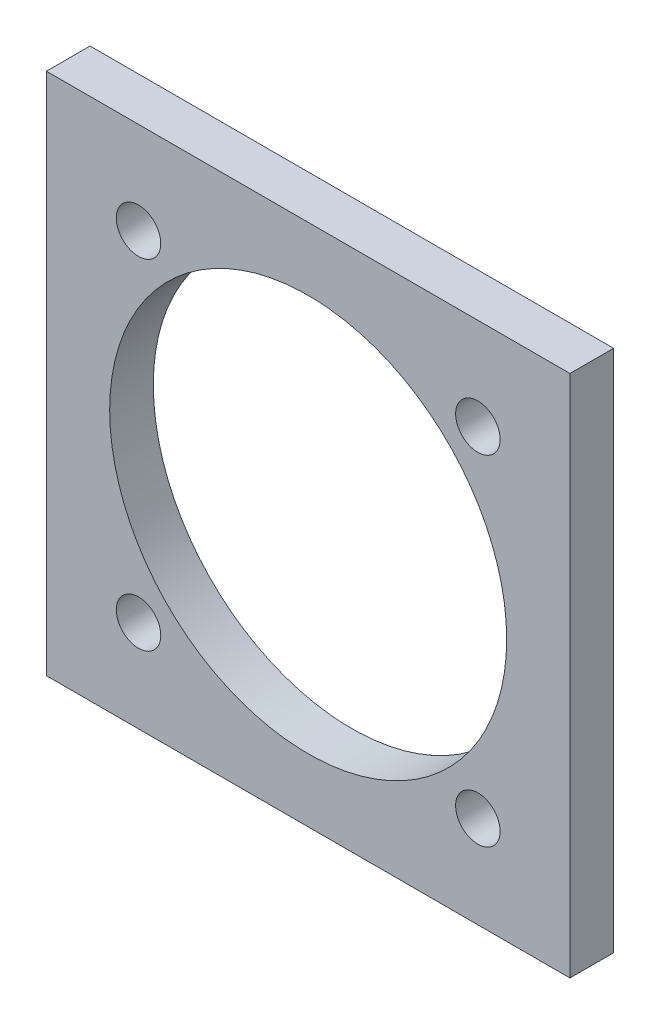
ISO-10303-21;
HEADER;
FILE_DESCRIPTION(('STEP AP214'),'2;1');
FILE_NAME('part.step','',(''),(''),'','','');
FILE_SCHEMA(('AUTOMOTIVE_DESIGN { 1 0 10303 214 1 1 1 1 }'));
ENDSEC;
DATA;
#1=APPLICATION_CONTEXT('core data for automotive mechanical design processes');
#2=APPLICATION_PROTOCOL_DEFINITION('international standard','automotive_design',2000,#1);
#3=PRODUCT_CONTEXT('',#1,'mechanical');
#4=PRODUCT('Part','Part','',(#3));
#5=PRODUCT_RELATED_PRODUCT_CATEGORY('part','',(#4));
#6=PRODUCT_DEFINITION_FORMATION('','',#4);
#7=PRODUCT_DEFINITION_CONTEXT('part definition',#1,'design');
#8=PRODUCT_DEFINITION('design','',#6,#7);
#9=PRODUCT_DEFINITION_SHAPE('','',#8);
#10=(LENGTH_UNIT() NAMED_UNIT(*) SI_UNIT(.MILLI.,.METRE.));
#11=(NAMED_UNIT(*) PLANE_ANGLE_UNIT() SI_UNIT($,.RADIAN.));
#12=(NAMED_UNIT(*) SI_UNIT($,.STERADIAN.) SOLID_ANGLE_UNIT());
#13=UNCERTAINTY_MEASURE_WITH_UNIT(LENGTH_MEASURE(1.E-05),#10,'distance_accuracy_value','');
#14=(GEOMETRIC_REPRESENTATION_CONTEXT(3) GLOBAL_UNCERTAINTY_ASSIGNED_CONTEXT((#13)) GLOBAL_UNIT_ASSIGNED_CONTEXT((#10,
#11,#12)) REPRESENTATION_CONTEXT('',''));
#15=CARTESIAN_POINT('',(0.,0.,0.));
#16=DIRECTION('',(0.,0.,1.));
#17=DIRECTION('',(1.,0.,0.));
#18=AXIS2_PLACEMENT_3D('',#15,#16,#17);
#19=CARTESIAN_POINT('',(0.,0.,10.));
#20=DIRECTION('',(0.,0.,-1.));
#21=DIRECTION('',(-1.,0.,0.));
#22=AXIS2_PLACEMENT_3D('',#19,#20,#21);
#23=PLANE('',#22);
#24=DIRECTION('',(0.,1.,0.));
#25=VECTOR('',#24,1.);
#26=CARTESIAN_POINT('',(60.,-60.,10.));
#27=LINE('',#26,#25);
#28=CARTESIAN_POINT('',(60.,-60.,10.));
#29=VERTEX_POINT('',#28);
#30=CARTESIAN_POINT('',(60.,60.,10.));
#31=VERTEX_POINT('',#30);
#32=EDGE_CURVE('E86',#29,#31,#27,.T.);
#33=ORIENTED_EDGE('',*,*,#32,.T.);
#34=DIRECTION('',(-1.,0.,0.));
#35=VECTOR('',#34,1.);
#36=CARTESIAN_POINT('',(-60.,60.,10.));
#37=LINE('',#36,#35);
#38=CARTESIAN_POINT('',(-60.,60.,10.));
#39=VERTEX_POINT('',#38);
#40=EDGE_CURVE('E81',#31,#39,#37,.T.);
#41=ORIENTED_EDGE('',*,*,#40,.T.);
#42=DIRECTION('',(0.,-1.,0.));
#43=VECTOR('',#42,1.);
#44=CARTESIAN_POINT('',(-60.,-60.,10.));
#45=LINE('',#44,#43);
#46=CARTESIAN_POINT('',(-60.,-60.,10.));
#47=VERTEX_POINT('',#46);
#48=EDGE_CURVE('E84',#39,#47,#45,.T.);
#49=ORIENTED_EDGE('',*,*,#48,.T.);
#50=DIRECTION('',(1.,0.,0.));
#51=VECTOR('',#50,1.);
#52=CARTESIAN_POINT('',(-60.,-60.,10.));
#53=LINE('',#52,#51);
#54=EDGE_CURVE('E51',#47,#29,#53,.T.);
#55=ORIENTED_EDGE('',*,*,#54,.T.);
#56=EDGE_LOOP('',(#33,#41,#49,#55));
#57=FACE_BOUND('',#56,.T.);
#58=CARTESIAN_POINT('',(0.,0.,10.));
#59=DIRECTION('',(0.,0.,1.));
#60=DIRECTION('',(1.,0.,0.));
#61=AXIS2_PLACEMENT_3D('',#58,#59,#60);
#62=CIRCLE('',#61,45.5);
#63=CARTESIAN_POINT('',(45.5,0.,10.));
#64=VERTEX_POINT('',#63);
#65=EDGE_CURVE('E101',#64,#64,#62,.T.);
#66=ORIENTED_EDGE('',*,*,#65,.F.);
#67=EDGE_LOOP('',(#66));
#68=FACE_BOUND('',#67,.T.);
#69=CARTESIAN_POINT('',(38.8908729652601,38.8908729652601,10.));
#70=DIRECTION('',(0.,0.,1.));
#71=DIRECTION('',(1.,0.,0.));
#72=AXIS2_PLACEMENT_3D('',#69,#70,#71);
#73=CIRCLE('',#72,5.1);
#74=CARTESIAN_POINT('',(43.9908729652601,38.8908729652601,10.));
#75=VERTEX_POINT('',#74);
#76=EDGE_CURVE('E116',#75,#75,#73,.T.);
#77=ORIENTED_EDGE('',*,*,#76,.F.);
#78=EDGE_LOOP('',(#77));
#79=FACE_BOUND('',#78,.T.);
#80=CARTESIAN_POINT('',(-38.8908729652601,38.8908729652601,10.));
#81=DIRECTION('',(0.,0.,1.));
#82=DIRECTION('',(1.,0.,0.));
#83=AXIS2_PLACEMENT_3D('',#80,#81,#82);
#84=CIRCLE('',#83,5.1);
#85=CARTESIAN_POINT('',(-33.7908729652601,38.8908729652601,10.));
#86=VERTEX_POINT('',#85);
#87=EDGE_CURVE('E122',#86,#86,#84,.T.);
#88=ORIENTED_EDGE('',*,*,#87,.F.);
#89=EDGE_LOOP('',(#88));
#90=FACE_BOUND('',#89,.T.);
#91=CARTESIAN_POINT('',(38.8908729652601,-38.8908729652601,10.));
#92=DIRECTION('',(0.,0.,1.));
#93=DIRECTION('',(1.,0.,0.));
#94=AXIS2_PLACEMENT_3D('',#91,#92,#93);
#95=CIRCLE('',#94,5.1);
#96=CARTESIAN_POINT('',(43.9908729652601,-38.8908729652601,10.));
#97=VERTEX_POINT('',#96);
#98=EDGE_CURVE('E128',#97,#97,#95,.T.);
#99=ORIENTED_EDGE('',*,*,#98,.F.);
#100=EDGE_LOOP('',(#99));
#101=FACE_BOUND('',#100,.T.);
#102=CARTESIAN_POINT('',(-38.8908729652601,-38.8908729652601,10.));
#103=DIRECTION('',(0.,0.,1.));
#104=DIRECTION('',(1.,0.,0.));
#105=AXIS2_PLACEMENT_3D('',#102,#103,#104);
#106=CIRCLE('',#105,5.1);
#107=CARTESIAN_POINT('',(-33.7908729652601,-38.8908729652601,10.));
#108=VERTEX_POINT('',#107);
#109=EDGE_CURVE('E134',#108,#108,#106,.T.);
#110=ORIENTED_EDGE('',*,*,#109,.F.);
#111=EDGE_LOOP('',(#110));
#112=FACE_BOUND('',#111,.T.);
#113=ADVANCED_FACE('F34',(#57,#68,#79,#90,#101,#112),#23,.F.);
#114=CARTESIAN_POINT('',(0.,0.,0.));
#115=DIRECTION('',(0.,0.,-1.));
#116=DIRECTION('',(-1.,0.,0.));
#117=AXIS2_PLACEMENT_3D('',#114,#115,#116);
#118=PLANE('',#117);
#119=CARTESIAN_POINT('',(38.8908729652601,-38.8908729652601,0.));
#120=DIRECTION('',(0.,0.,1.));
#121=DIRECTION('',(1.,0.,0.));
#122=AXIS2_PLACEMENT_3D('',#119,#120,#121);
#123=CIRCLE('',#122,5.1);
#124=CARTESIAN_POINT('',(43.9908729652601,-38.8908729652601,0.));
#125=VERTEX_POINT('',#124);
#126=EDGE_CURVE('E131',#125,#125,#123,.T.);
#127=ORIENTED_EDGE('',*,*,#126,.T.);
#128=EDGE_LOOP('',(#127));
#129=FACE_BOUND('',#128,.T.);
#130=CARTESIAN_POINT('',(38.8908729652601,38.8908729652601,0.));
#131=DIRECTION('',(0.,0.,1.));
#132=DIRECTION('',(1.,0.,0.));
#133=AXIS2_PLACEMENT_3D('',#130,#131,#132);
#134=CIRCLE('',#133,5.1);
#135=CARTESIAN_POINT('',(43.9908729652601,38.8908729652601,0.));
#136=VERTEX_POINT('',#135);
#137=EDGE_CURVE('E119',#136,#136,#134,.T.);
#138=ORIENTED_EDGE('',*,*,#137,.T.);
#139=EDGE_LOOP('',(#138));
#140=FACE_BOUND('',#139,.T.);
#141=DIRECTION('',(0.,1.,0.));
#142=VECTOR('',#141,1.);
#143=CARTESIAN_POINT('',(60.,-60.,0.));
#144=LINE('',#143,#142);
#145=CARTESIAN_POINT('',(60.,-60.,0.));
#146=VERTEX_POINT('',#145);
#147=CARTESIAN_POINT('',(60.,60.,0.));
#148=VERTEX_POINT('',#147);
#149=EDGE_CURVE('E98',#146,#148,#144,.T.);
#150=ORIENTED_EDGE('',*,*,#149,.F.);
#151=DIRECTION('',(1.,0.,0.));
#152=VECTOR('',#151,1.);
#153=CARTESIAN_POINT('',(-60.,-60.,0.));
#154=LINE('',#153,#152);
#155=CARTESIAN_POINT('',(-60.,-60.,0.));
#156=VERTEX_POINT('',#155);
#157=EDGE_CURVE('E74',#156,#146,#154,.T.);
#158=ORIENTED_EDGE('',*,*,#157,.F.);
#159=DIRECTION('',(0.,-1.,0.));
#160=VECTOR('',#159,1.);
#161=CARTESIAN_POINT('',(-60.,-60.,0.));
#162=LINE('',#161,#160);
#163=CARTESIAN_POINT('',(-60.,60.,0.));
#164=VERTEX_POINT('',#163);
#165=EDGE_CURVE('E68',#164,#156,#162,.T.);
#166=ORIENTED_EDGE('',*,*,#165,.F.);
#167=DIRECTION('',(-1.,0.,0.));
#168=VECTOR('',#167,1.);
#169=CARTESIAN_POINT('',(-60.,60.,0.));
#170=LINE('',#169,#168);
#171=EDGE_CURVE('E90',#148,#164,#170,.T.);
#172=ORIENTED_EDGE('',*,*,#171,.F.);
#173=EDGE_LOOP('',(#150,#158,#166,#172));
#174=FACE_BOUND('',#173,.T.);
#175=CARTESIAN_POINT('',(0.,0.,0.));
#176=DIRECTION('',(0.,0.,1.));
#177=DIRECTION('',(1.,0.,0.));
#178=AXIS2_PLACEMENT_3D('',#175,#176,#177);
#179=CIRCLE('',#178,45.5);
#180=CARTESIAN_POINT('',(45.5,0.,0.));
#181=VERTEX_POINT('',#180);
#182=EDGE_CURVE('E113',#181,#181,#179,.T.);
#183=ORIENTED_EDGE('',*,*,#182,.T.);
#184=EDGE_LOOP('',(#183));
#185=FACE_BOUND('',#184,.T.);
#186=CARTESIAN_POINT('',(-38.8908729652601,38.8908729652601,0.));
#187=DIRECTION('',(0.,0.,1.));
#188=DIRECTION('',(1.,0.,0.));
#189=AXIS2_PLACEMENT_3D('',#186,#187,#188);
#190=CIRCLE('',#189,5.1);
#191=CARTESIAN_POINT('',(-33.7908729652601,38.8908729652601,0.));
#192=VERTEX_POINT('',#191);
#193=EDGE_CURVE('E125',#192,#192,#190,.T.);
#194=ORIENTED_EDGE('',*,*,#193,.T.);
#195=EDGE_LOOP('',(#194));
#196=FACE_BOUND('',#195,.T.);
#197=CARTESIAN_POINT('',(-38.8908729652601,-38.8908729652601,0.));
#198=DIRECTION('',(0.,0.,1.));
#199=DIRECTION('',(1.,0.,0.));
#200=AXIS2_PLACEMENT_3D('',#197,#198,#199);
#201=CIRCLE('',#200,5.1);
#202=CARTESIAN_POINT('',(-33.7908729652601,-38.8908729652601,0.));
#203=VERTEX_POINT('',#202);
#204=EDGE_CURVE('E137',#203,#203,#201,.T.);
#205=ORIENTED_EDGE('',*,*,#204,.T.);
#206=EDGE_LOOP('',(#205));
#207=FACE_BOUND('',#206,.T.);
#208=ADVANCED_FACE('F109',(#129,#140,#174,#185,#196,#207),#118,.T.);
#209=CARTESIAN_POINT('',(60.,-60.,10.));
#210=DIRECTION('',(-1.,0.,0.));
#211=DIRECTION('',(0.,0.,1.));
#212=AXIS2_PLACEMENT_3D('',#209,#210,#211);
#213=PLANE('',#212);
#214=ORIENTED_EDGE('',*,*,#149,.T.);
#215=DIRECTION('',(0.,0.,-1.));
#216=VECTOR('',#215,1.);
#217=CARTESIAN_POINT('',(60.,60.,10.));
#218=LINE('',#217,#216);
#219=EDGE_CURVE('E11',#31,#148,#218,.T.);
#220=ORIENTED_EDGE('',*,*,#219,.F.);
#221=ORIENTED_EDGE('',*,*,#32,.F.);
#222=DIRECTION('',(0.,0.,-1.));
#223=VECTOR('',#222,1.);
#224=CARTESIAN_POINT('',(60.,-60.,10.));
#225=LINE('',#224,#223);
#226=EDGE_CURVE('E94',#29,#146,#225,.T.);
#227=ORIENTED_EDGE('',*,*,#226,.T.);
#228=EDGE_LOOP('',(#214,#220,#221,#227));
#229=FACE_BOUND('',#228,.T.);
#230=ADVANCED_FACE('F36',(#229),#213,.F.);
#231=CARTESIAN_POINT('',(-60.,60.,10.));
#232=DIRECTION('',(0.,-1.,0.));
#233=DIRECTION('',(0.,0.,-1.));
#234=AXIS2_PLACEMENT_3D('',#231,#232,#233);
#235=PLANE('',#234);
#236=ORIENTED_EDGE('',*,*,#171,.T.);
#237=DIRECTION('',(0.,0.,-1.));
#238=VECTOR('',#237,1.);
#239=CARTESIAN_POINT('',(-60.,60.,10.));
#240=LINE('',#239,#238);
#241=EDGE_CURVE('E43',#39,#164,#240,.T.);
#242=ORIENTED_EDGE('',*,*,#241,.F.);
#243=ORIENTED_EDGE('',*,*,#40,.F.);
#244=ORIENTED_EDGE('',*,*,#219,.T.);
#245=EDGE_LOOP('',(#236,#242,#243,#244));
#246=FACE_BOUND('',#245,.T.);
#247=ADVANCED_FACE('F89',(#246),#235,.F.);
#248=CARTESIAN_POINT('',(-60.,-60.,10.));
#249=DIRECTION('',(1.,0.,0.));
#250=DIRECTION('',(0.,0.,-1.));
#251=AXIS2_PLACEMENT_3D('',#248,#249,#250);
#252=PLANE('',#251);
#253=ORIENTED_EDGE('',*,*,#165,.T.);
#254=DIRECTION('',(0.,0.,-1.));
#255=VECTOR('',#254,1.);
#256=CARTESIAN_POINT('',(-60.,-60.,10.));
#257=LINE('',#256,#255);
#258=EDGE_CURVE('E91',#47,#156,#257,.T.);
#259=ORIENTED_EDGE('',*,*,#258,.F.);
#260=ORIENTED_EDGE('',*,*,#48,.F.);
#261=ORIENTED_EDGE('',*,*,#241,.T.);
#262=EDGE_LOOP('',(#253,#259,#260,#261));
#263=FACE_BOUND('',#262,.T.);
#264=ADVANCED_FACE('F92',(#263),#252,.F.);
#265=CARTESIAN_POINT('',(-60.,-60.,10.));
#266=DIRECTION('',(0.,1.,0.));
#267=DIRECTION('',(0.,0.,1.));
#268=AXIS2_PLACEMENT_3D('',#265,#266,#267);
#269=PLANE('',#268);
#270=ORIENTED_EDGE('',*,*,#157,.T.);
#271=ORIENTED_EDGE('',*,*,#226,.F.);
#272=ORIENTED_EDGE('',*,*,#54,.F.);
#273=ORIENTED_EDGE('',*,*,#258,.T.);
#274=EDGE_LOOP('',(#270,#271,#272,#273));
#275=FACE_BOUND('',#274,.T.);
#276=ADVANCED_FACE('F106',(#275),#269,.F.);
#277=CARTESIAN_POINT('',(0.,0.,10.));
#278=DIRECTION('',(0.,0.,-1.));
#279=DIRECTION('',(-1.,0.,0.));
#280=AXIS2_PLACEMENT_3D('',#277,#278,#279);
#281=CYLINDRICAL_SURFACE('',#280,45.5);
#282=ORIENTED_EDGE('',*,*,#65,.T.);
#283=EDGE_LOOP('',(#282));
#284=FACE_BOUND('',#283,.T.);
#285=ORIENTED_EDGE('',*,*,#182,.F.);
#286=EDGE_LOOP('',(#285));
#287=FACE_BOUND('',#286,.T.);
#288=ADVANCED_FACE('F154',(#284,#287),#281,.F.);
#289=CARTESIAN_POINT('',(38.8908729652601,38.8908729652601,10.));
#290=DIRECTION('',(0.,0.,-1.));
#291=DIRECTION('',(-1.,0.,0.));
#292=AXIS2_PLACEMENT_3D('',#289,#290,#291);
#293=CYLINDRICAL_SURFACE('',#292,5.1);
#294=ORIENTED_EDGE('',*,*,#76,.T.);
#295=EDGE_LOOP('',(#294));
#296=FACE_BOUND('',#295,.T.);
#297=ORIENTED_EDGE('',*,*,#137,.F.);
#298=EDGE_LOOP('',(#297));
#299=FACE_BOUND('',#298,.T.);
#300=ADVANCED_FACE('F200',(#296,#299),#293,.F.);
#301=CARTESIAN_POINT('',(-38.8908729652601,38.8908729652601,10.));
#302=DIRECTION('',(0.,0.,-1.));
#303=DIRECTION('',(-1.,0.,0.));
#304=AXIS2_PLACEMENT_3D('',#301,#302,#303);
#305=CYLINDRICAL_SURFACE('',#304,5.1);
#306=ORIENTED_EDGE('',*,*,#87,.T.);
#307=EDGE_LOOP('',(#306));
#308=FACE_BOUND('',#307,.T.);
#309=ORIENTED_EDGE('',*,*,#193,.F.);
#310=EDGE_LOOP('',(#309));
#311=FACE_BOUND('',#310,.T.);
#312=ADVANCED_FACE('F208',(#308,#311),#305,.F.);
#313=CARTESIAN_POINT('',(38.8908729652601,-38.8908729652601,10.));
#314=DIRECTION('',(0.,0.,-1.));
#315=DIRECTION('',(-1.,0.,0.));
#316=AXIS2_PLACEMENT_3D('',#313,#314,#315);
#317=CYLINDRICAL_SURFACE('',#316,5.1);
#318=ORIENTED_EDGE('',*,*,#98,.T.);
#319=EDGE_LOOP('',(#318));
#320=FACE_BOUND('',#319,.T.);
#321=ORIENTED_EDGE('',*,*,#126,.F.);
#322=EDGE_LOOP('',(#321));
#323=FACE_BOUND('',#322,.T.);
#324=ADVANCED_FACE('F216',(#320,#323),#317,.F.);
#325=CARTESIAN_POINT('',(-38.8908729652601,-38.8908729652601,10.));
#326=DIRECTION('',(0.,0.,-1.));
#327=DIRECTION('',(-1.,0.,0.));
#328=AXIS2_PLACEMENT_3D('',#325,#326,#327);
#329=CYLINDRICAL_SURFACE('',#328,5.1);
#330=ORIENTED_EDGE('',*,*,#109,.T.);
#331=EDGE_LOOP('',(#330));
#332=FACE_BOUND('',#331,.T.);
#333=ORIENTED_EDGE('',*,*,#204,.F.);
#334=EDGE_LOOP('',(#333));
#335=FACE_BOUND('',#334,.T.);
#336=ADVANCED_FACE('F143',(#332,#335),#329,.F.);
#337=CLOSED_SHELL('',(#113,#208,#230,#247,#264,#276,#288,#300,#312,#324,#336));
#338=MANIFOLD_SOLID_BREP('B2',#337);
#339=ADVANCED_BREP_SHAPE_REPRESENTATION('',(#18,#338),#14);
#340=SHAPE_DEFINITION_REPRESENTATION(#9,#339);
ENDSEC;
END-ISO-10303-21;
